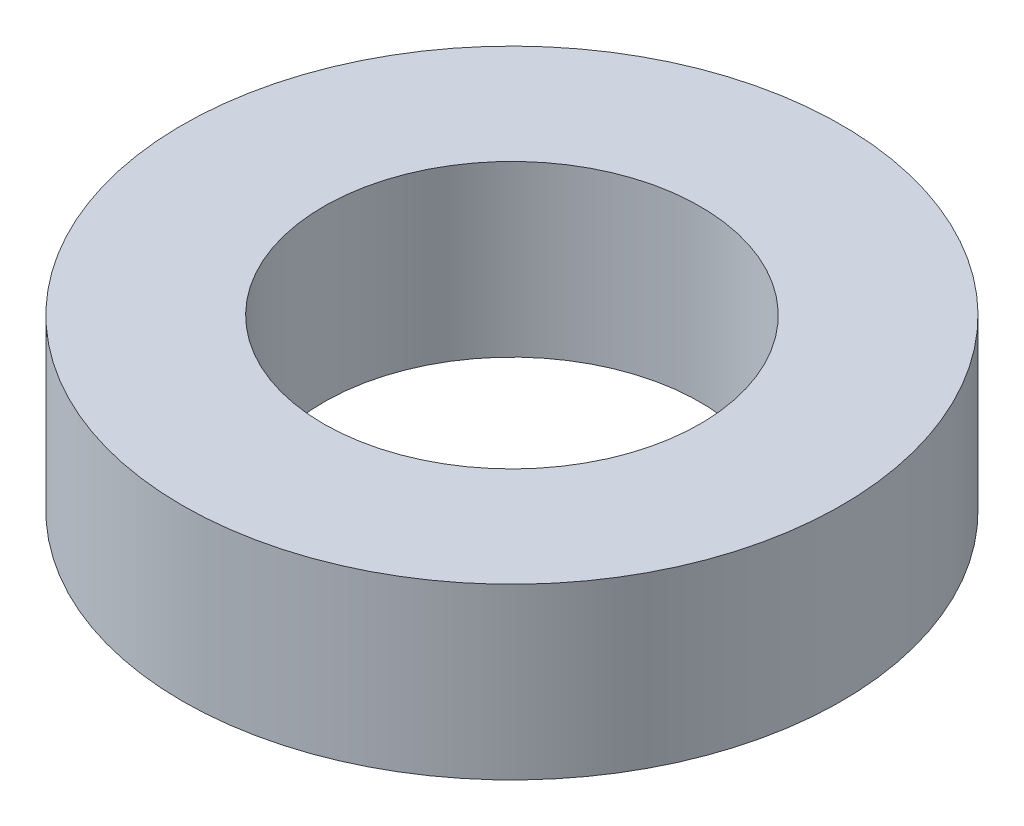
ISO-10303-21;
HEADER;
FILE_DESCRIPTION(('STEP AP214'),'2;1');
FILE_NAME('part.step','',(''),(''),'','','');
FILE_SCHEMA(('AUTOMOTIVE_DESIGN { 1 0 10303 214 1 1 1 1 }'));
ENDSEC;
DATA;
#1=APPLICATION_CONTEXT('core data for automotive mechanical design processes');
#2=APPLICATION_PROTOCOL_DEFINITION('international standard','automotive_design',2000,#1);
#3=PRODUCT_CONTEXT('',#1,'mechanical');
#4=PRODUCT('Part','Part','',(#3));
#5=PRODUCT_RELATED_PRODUCT_CATEGORY('part','',(#4));
#6=PRODUCT_DEFINITION_FORMATION('','',#4);
#7=PRODUCT_DEFINITION_CONTEXT('part definition',#1,'design');
#8=PRODUCT_DEFINITION('design','',#6,#7);
#9=PRODUCT_DEFINITION_SHAPE('','',#8);
#10=(LENGTH_UNIT() NAMED_UNIT(*) SI_UNIT(.MILLI.,.METRE.));
#11=(NAMED_UNIT(*) PLANE_ANGLE_UNIT() SI_UNIT($,.RADIAN.));
#12=(NAMED_UNIT(*) SI_UNIT($,.STERADIAN.) SOLID_ANGLE_UNIT());
#13=UNCERTAINTY_MEASURE_WITH_UNIT(LENGTH_MEASURE(1.E-05),#10,'distance_accuracy_value','');
#14=(GEOMETRIC_REPRESENTATION_CONTEXT(3) GLOBAL_UNCERTAINTY_ASSIGNED_CONTEXT((#13)) GLOBAL_UNIT_ASSIGNED_CONTEXT((#10,
#11,#12)) REPRESENTATION_CONTEXT('',''));
#15=CARTESIAN_POINT('',(0.,0.,0.));
#16=DIRECTION('',(0.,0.,1.));
#17=DIRECTION('',(1.,0.,0.));
#18=AXIS2_PLACEMENT_3D('',#15,#16,#17);
#19=CARTESIAN_POINT('',(0.,18.,0.));
#20=DIRECTION('',(0.,-1.,0.));
#21=DIRECTION('',(0.,0.,-1.));
#22=AXIS2_PLACEMENT_3D('',#19,#20,#21);
#23=CYLINDRICAL_SURFACE('',#22,35.);
#24=CARTESIAN_POINT('',(0.,18.,0.));
#25=DIRECTION('',(0.,1.,0.));
#26=DIRECTION('',(0.,0.,1.));
#27=AXIS2_PLACEMENT_3D('',#24,#25,#26);
#28=CIRCLE('',#27,35.);
#29=CARTESIAN_POINT('',(0.,18.,35.));
#30=VERTEX_POINT('',#29);
#31=EDGE_CURVE('E10',#30,#30,#28,.T.);
#32=ORIENTED_EDGE('',*,*,#31,.F.);
#33=EDGE_LOOP('',(#32));
#34=FACE_BOUND('',#33,.T.);
#35=CARTESIAN_POINT('',(0.,0.,0.));
#36=DIRECTION('',(0.,1.,0.));
#37=DIRECTION('',(0.,0.,1.));
#38=AXIS2_PLACEMENT_3D('',#35,#36,#37);
#39=CIRCLE('',#38,35.);
#40=CARTESIAN_POINT('',(0.,0.,35.));
#41=VERTEX_POINT('',#40);
#42=EDGE_CURVE('E37',#41,#41,#39,.T.);
#43=ORIENTED_EDGE('',*,*,#42,.T.);
#44=EDGE_LOOP('',(#43));
#45=FACE_BOUND('',#44,.T.);
#46=ADVANCED_FACE('F40',(#34,#45),#23,.T.);
#47=CARTESIAN_POINT('',(0.,18.,0.));
#48=DIRECTION('',(0.,1.,0.));
#49=DIRECTION('',(0.,0.,1.));
#50=AXIS2_PLACEMENT_3D('',#47,#48,#49);
#51=PLANE('',#50);
#52=CARTESIAN_POINT('',(0.,18.,0.));
#53=DIRECTION('',(0.,1.,0.));
#54=DIRECTION('',(0.,0.,1.));
#55=AXIS2_PLACEMENT_3D('',#52,#53,#54);
#56=CIRCLE('',#55,20.);
#57=CARTESIAN_POINT('',(0.,18.,20.));
#58=VERTEX_POINT('',#57);
#59=EDGE_CURVE('E50',#58,#58,#56,.T.);
#60=ORIENTED_EDGE('',*,*,#59,.F.);
#61=EDGE_LOOP('',(#60));
#62=FACE_BOUND('',#61,.T.);
#63=ORIENTED_EDGE('',*,*,#31,.T.);
#64=EDGE_LOOP('',(#63));
#65=FACE_BOUND('',#64,.T.);
#66=ADVANCED_FACE('F59',(#62,#65),#51,.T.);
#67=CARTESIAN_POINT('',(0.,0.,0.));
#68=DIRECTION('',(0.,1.,0.));
#69=DIRECTION('',(0.,0.,1.));
#70=AXIS2_PLACEMENT_3D('',#67,#68,#69);
#71=PLANE('',#70);
#72=CARTESIAN_POINT('',(0.,0.,0.));
#73=DIRECTION('',(0.,1.,0.));
#74=DIRECTION('',(0.,0.,1.));
#75=AXIS2_PLACEMENT_3D('',#72,#73,#74);
#76=CIRCLE('',#75,20.);
#77=CARTESIAN_POINT('',(0.,0.,20.));
#78=VERTEX_POINT('',#77);
#79=EDGE_CURVE('E47',#78,#78,#76,.T.);
#80=ORIENTED_EDGE('',*,*,#79,.T.);
#81=EDGE_LOOP('',(#80));
#82=FACE_BOUND('',#81,.T.);
#83=ORIENTED_EDGE('',*,*,#42,.F.);
#84=EDGE_LOOP('',(#83));
#85=FACE_BOUND('',#84,.T.);
#86=ADVANCED_FACE('F58',(#82,#85),#71,.F.);
#87=CARTESIAN_POINT('',(0.,18.,0.));
#88=DIRECTION('',(0.,-1.,0.));
#89=DIRECTION('',(0.,0.,-1.));
#90=AXIS2_PLACEMENT_3D('',#87,#88,#89);
#91=CYLINDRICAL_SURFACE('',#90,20.);
#92=ORIENTED_EDGE('',*,*,#59,.T.);
#93=EDGE_LOOP('',(#92));
#94=FACE_BOUND('',#93,.T.);
#95=ORIENTED_EDGE('',*,*,#79,.F.);
#96=EDGE_LOOP('',(#95));
#97=FACE_BOUND('',#96,.T.);
#98=ADVANCED_FACE('F54',(#94,#97),#91,.F.);
#99=CLOSED_SHELL('',(#46,#66,#86,#98));
#100=MANIFOLD_SOLID_BREP('B2',#99);
#101=ADVANCED_BREP_SHAPE_REPRESENTATION('',(#18,#100),#14);
#102=SHAPE_DEFINITION_REPRESENTATION(#9,#101);
ENDSEC;
END-ISO-10303-21;
